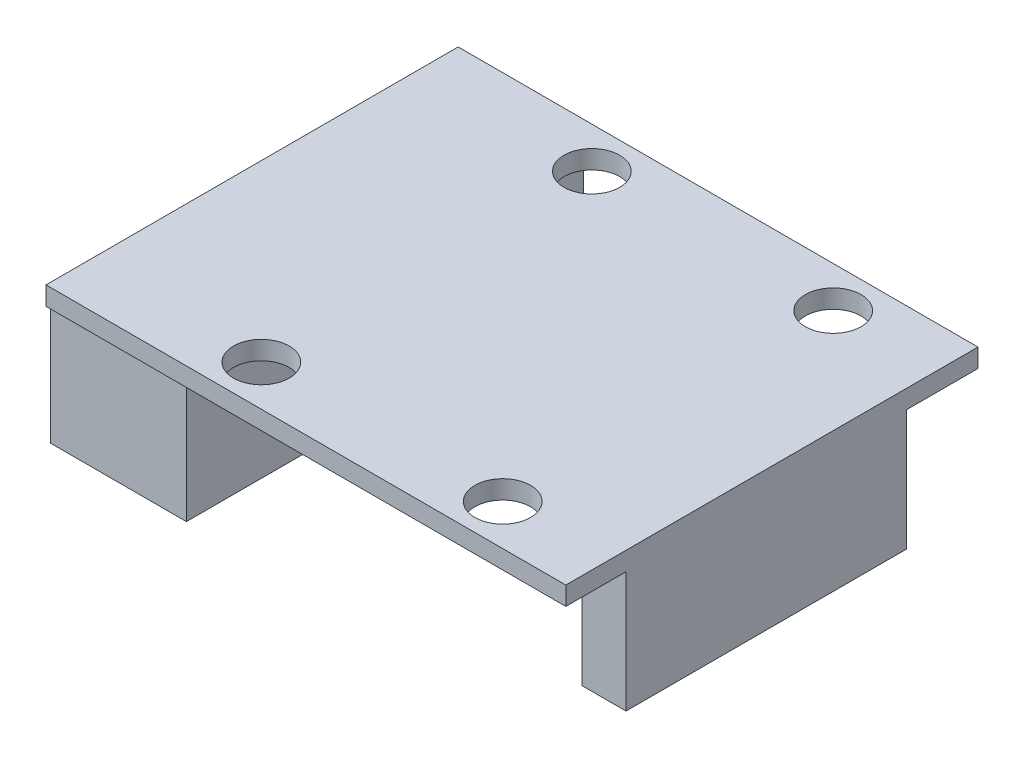
ISO-10303-21;
HEADER;
FILE_DESCRIPTION(('STEP AP214'),'2;1');
FILE_NAME('part.step','',(''),(''),'','','');
FILE_SCHEMA(('AUTOMOTIVE_DESIGN { 1 0 10303 214 1 1 1 1 }'));
ENDSEC;
DATA;
#1=APPLICATION_CONTEXT('core data for automotive mechanical design processes');
#2=APPLICATION_PROTOCOL_DEFINITION('international standard','automotive_design',2000,#1);
#3=PRODUCT_CONTEXT('',#1,'mechanical');
#4=PRODUCT('Part','Part','',(#3));
#5=PRODUCT_RELATED_PRODUCT_CATEGORY('part','',(#4));
#6=PRODUCT_DEFINITION_FORMATION('','',#4);
#7=PRODUCT_DEFINITION_CONTEXT('part definition',#1,'design');
#8=PRODUCT_DEFINITION('design','',#6,#7);
#9=PRODUCT_DEFINITION_SHAPE('','',#8);
#10=(LENGTH_UNIT() NAMED_UNIT(*) SI_UNIT(.MILLI.,.METRE.));
#11=(NAMED_UNIT(*) PLANE_ANGLE_UNIT() SI_UNIT($,.RADIAN.));
#12=(NAMED_UNIT(*) SI_UNIT($,.STERADIAN.) SOLID_ANGLE_UNIT());
#13=UNCERTAINTY_MEASURE_WITH_UNIT(LENGTH_MEASURE(1.E-05),#10,'distance_accuracy_value','');
#14=(GEOMETRIC_REPRESENTATION_CONTEXT(3) GLOBAL_UNCERTAINTY_ASSIGNED_CONTEXT((#13)) GLOBAL_UNIT_ASSIGNED_CONTEXT((#10,
#11,#12)) REPRESENTATION_CONTEXT('',''));
#15=CARTESIAN_POINT('',(0.,0.,0.));
#16=DIRECTION('',(0.,0.,1.));
#17=DIRECTION('',(1.,0.,0.));
#18=AXIS2_PLACEMENT_3D('',#15,#16,#17);
#19=CARTESIAN_POINT('',(0.,0.,0.));
#20=DIRECTION('',(0.,-1.,0.));
#21=DIRECTION('',(0.,0.,-1.));
#22=AXIS2_PLACEMENT_3D('',#19,#20,#21);
#23=PLANE('',#22);
#24=CARTESIAN_POINT('',(22.4,0.,-2.2));
#25=DIRECTION('',(0.,1.,0.));
#26=DIRECTION('',(0.,0.,1.));
#27=AXIS2_PLACEMENT_3D('',#24,#25,#26);
#28=CIRCLE('',#27,1.5);
#29=CARTESIAN_POINT('',(22.4,0.,-0.699999999999999));
#30=VERTEX_POINT('',#29);
#31=EDGE_CURVE('E279',#30,#30,#28,.T.);
#32=ORIENTED_EDGE('',*,*,#31,.T.);
#33=EDGE_LOOP('',(#32));
#34=FACE_BOUND('',#33,.T.);
#35=CARTESIAN_POINT('',(9.4,0.,-20.));
#36=DIRECTION('',(0.,1.,0.));
#37=DIRECTION('',(0.,0.,1.));
#38=AXIS2_PLACEMENT_3D('',#35,#36,#37);
#39=CIRCLE('',#38,1.5);
#40=CARTESIAN_POINT('',(9.4,0.,-18.5));
#41=VERTEX_POINT('',#40);
#42=EDGE_CURVE('E292',#41,#41,#39,.T.);
#43=ORIENTED_EDGE('',*,*,#42,.T.);
#44=EDGE_LOOP('',(#43));
#45=FACE_BOUND('',#44,.T.);
#46=CARTESIAN_POINT('',(22.4,0.,-20.));
#47=DIRECTION('',(0.,1.,0.));
#48=DIRECTION('',(0.,0.,1.));
#49=AXIS2_PLACEMENT_3D('',#46,#47,#48);
#50=CIRCLE('',#49,1.5);
#51=CARTESIAN_POINT('',(22.4,0.,-18.5));
#52=VERTEX_POINT('',#51);
#53=EDGE_CURVE('E286',#52,#52,#50,.T.);
#54=ORIENTED_EDGE('',*,*,#53,.T.);
#55=EDGE_LOOP('',(#54));
#56=FACE_BOUND('',#55,.T.);
#57=CARTESIAN_POINT('',(9.4,0.,-2.2));
#58=DIRECTION('',(0.,1.,0.));
#59=DIRECTION('',(0.,0.,1.));
#60=AXIS2_PLACEMENT_3D('',#57,#58,#59);
#61=CIRCLE('',#60,1.5);
#62=CARTESIAN_POINT('',(9.4,0.,-0.699999999999998));
#63=VERTEX_POINT('',#62);
#64=EDGE_CURVE('E274',#63,#63,#61,.T.);
#65=ORIENTED_EDGE('',*,*,#64,.T.);
#66=EDGE_LOOP('',(#65));
#67=FACE_BOUND('',#66,.T.);
#68=DIRECTION('',(0.,0.,-1.));
#69=VECTOR('',#68,1.);
#70=CARTESIAN_POINT('',(28.,0.,0.));
#71=LINE('',#70,#69);
#72=CARTESIAN_POINT('',(28.,0.,-18.354409606166));
#73=VERTEX_POINT('',#72);
#74=CARTESIAN_POINT('',(28.,0.,-22.2));
#75=VERTEX_POINT('',#74);
#76=EDGE_CURVE('E321',#73,#75,#71,.T.);
#77=ORIENTED_EDGE('',*,*,#76,.F.);
#78=DIRECTION('',(1.,0.,0.));
#79=VECTOR('',#78,1.);
#80=CARTESIAN_POINT('',(25.6254876265779,0.,-18.354409606166));
#81=LINE('',#80,#79);
#82=CARTESIAN_POINT('',(25.6254876265779,0.,-18.354409606166));
#83=VERTEX_POINT('',#82);
#84=EDGE_CURVE('E344',#83,#73,#81,.T.);
#85=ORIENTED_EDGE('',*,*,#84,.F.);
#86=DIRECTION('',(0.,0.,-1.));
#87=VECTOR('',#86,1.);
#88=CARTESIAN_POINT('',(25.6254876265779,0.,-18.354409606166));
#89=LINE('',#88,#87);
#90=CARTESIAN_POINT('',(25.6254876265779,0.,-3.23995910184949));
#91=VERTEX_POINT('',#90);
#92=EDGE_CURVE('E195',#91,#83,#89,.T.);
#93=ORIENTED_EDGE('',*,*,#92,.F.);
#94=DIRECTION('',(-1.,0.,0.));
#95=VECTOR('',#94,1.);
#96=CARTESIAN_POINT('',(25.6254876265779,0.,-3.23995910184949));
#97=LINE('',#96,#95);
#98=CARTESIAN_POINT('',(28.,0.,-3.23995910184949));
#99=VERTEX_POINT('',#98);
#100=EDGE_CURVE('E191',#99,#91,#97,.T.);
#101=ORIENTED_EDGE('',*,*,#100,.F.);
#102=CARTESIAN_POINT('',(28.,0.,0.));
#103=VERTEX_POINT('',#102);
#104=EDGE_CURVE('E322',#103,#99,#71,.T.);
#105=ORIENTED_EDGE('',*,*,#104,.F.);
#106=DIRECTION('',(1.,0.,0.));
#107=VECTOR('',#106,1.);
#108=CARTESIAN_POINT('',(0.,0.,0.));
#109=LINE('',#108,#107);
#110=CARTESIAN_POINT('',(0.,0.,0.));
#111=VERTEX_POINT('',#110);
#112=EDGE_CURVE('E317',#111,#103,#109,.T.);
#113=ORIENTED_EDGE('',*,*,#112,.F.);
#114=DIRECTION('',(0.,0.,1.));
#115=VECTOR('',#114,1.);
#116=CARTESIAN_POINT('',(0.,0.,0.));
#117=LINE('',#116,#115);
#118=CARTESIAN_POINT('',(0.,0.,-0.238134437228928));
#119=VERTEX_POINT('',#118);
#120=EDGE_CURVE('E298',#119,#111,#117,.T.);
#121=ORIENTED_EDGE('',*,*,#120,.F.);
#122=DIRECTION('',(-1.,0.,0.));
#123=VECTOR('',#122,1.);
#124=CARTESIAN_POINT('',(0.,0.,-0.238134437228928));
#125=LINE('',#124,#123);
#126=CARTESIAN_POINT('',(7.32488989051539,0.,-0.238134437228928));
#127=VERTEX_POINT('',#126);
#128=EDGE_CURVE('E211',#127,#119,#125,.T.);
#129=ORIENTED_EDGE('',*,*,#128,.F.);
#130=DIRECTION('',(0.,0.,1.));
#131=VECTOR('',#130,1.);
#132=CARTESIAN_POINT('',(7.32488989051539,0.,-10.5601981962743));
#133=LINE('',#132,#131);
#134=CARTESIAN_POINT('',(7.32488989051539,0.,-10.5601981962743));
#135=VERTEX_POINT('',#134);
#136=EDGE_CURVE('E200',#135,#127,#133,.T.);
#137=ORIENTED_EDGE('',*,*,#136,.F.);
#138=DIRECTION('',(1.,0.,0.));
#139=VECTOR('',#138,1.);
#140=CARTESIAN_POINT('',(0.,0.,-10.5601981962743));
#141=LINE('',#140,#139);
#142=CARTESIAN_POINT('',(0.,0.,-10.5601981962743));
#143=VERTEX_POINT('',#142);
#144=EDGE_CURVE('E197',#143,#135,#141,.T.);
#145=ORIENTED_EDGE('',*,*,#144,.F.);
#146=CARTESIAN_POINT('',(0.,0.,-11.429147441296));
#147=VERTEX_POINT('',#146);
#148=EDGE_CURVE('E318',#147,#143,#117,.T.);
#149=ORIENTED_EDGE('',*,*,#148,.F.);
#150=DIRECTION('',(-1.,0.,0.));
#151=VECTOR('',#150,1.);
#152=CARTESIAN_POINT('',(0.,0.,-11.429147441296));
#153=LINE('',#152,#151);
#154=CARTESIAN_POINT('',(7.14056732338946,0.,-11.429147441296));
#155=VERTEX_POINT('',#154);
#156=EDGE_CURVE('E243',#155,#147,#153,.T.);
#157=ORIENTED_EDGE('',*,*,#156,.F.);
#158=DIRECTION('',(0.,0.,1.));
#159=VECTOR('',#158,1.);
#160=CARTESIAN_POINT('',(7.14056732338946,0.,-21.8038747909487));
#161=LINE('',#160,#159);
#162=CARTESIAN_POINT('',(7.14056732338946,0.,-21.8038747909487));
#163=VERTEX_POINT('',#162);
#164=EDGE_CURVE('E254',#163,#155,#161,.T.);
#165=ORIENTED_EDGE('',*,*,#164,.F.);
#166=DIRECTION('',(1.,0.,0.));
#167=VECTOR('',#166,1.);
#168=CARTESIAN_POINT('',(0.,0.,-21.8038747909487));
#169=LINE('',#168,#167);
#170=CARTESIAN_POINT('',(0.,0.,-21.8038747909487));
#171=VERTEX_POINT('',#170);
#172=EDGE_CURVE('E237',#171,#163,#169,.T.);
#173=ORIENTED_EDGE('',*,*,#172,.F.);
#174=CARTESIAN_POINT('',(0.,0.,-22.2));
#175=VERTEX_POINT('',#174);
#176=EDGE_CURVE('E314',#175,#171,#117,.T.);
#177=ORIENTED_EDGE('',*,*,#176,.F.);
#178=DIRECTION('',(-1.,0.,0.));
#179=VECTOR('',#178,1.);
#180=CARTESIAN_POINT('',(0.,0.,-22.2));
#181=LINE('',#180,#179);
#182=EDGE_CURVE('E306',#75,#175,#181,.T.);
#183=ORIENTED_EDGE('',*,*,#182,.F.);
#184=EDGE_LOOP('',(#77,#85,#93,#101,#105,#113,#121,#129,#137,#145,#149,#157,#165,#173,#177,#183));
#185=FACE_BOUND('',#184,.T.);
#186=ADVANCED_FACE('F43',(#34,#45,#56,#67,#185),#23,.T.);
#187=CARTESIAN_POINT('',(0.,1.,0.));
#188=DIRECTION('',(0.,-1.,0.));
#189=DIRECTION('',(0.,0.,-1.));
#190=AXIS2_PLACEMENT_3D('',#187,#188,#189);
#191=PLANE('',#190);
#192=DIRECTION('',(0.,0.,1.));
#193=VECTOR('',#192,1.);
#194=CARTESIAN_POINT('',(0.,1.,0.));
#195=LINE('',#194,#193);
#196=CARTESIAN_POINT('',(0.,1.,-22.2));
#197=VERTEX_POINT('',#196);
#198=CARTESIAN_POINT('',(0.,1.,0.));
#199=VERTEX_POINT('',#198);
#200=EDGE_CURVE('E301',#197,#199,#195,.T.);
#201=ORIENTED_EDGE('',*,*,#200,.T.);
#202=DIRECTION('',(1.,0.,0.));
#203=VECTOR('',#202,1.);
#204=CARTESIAN_POINT('',(0.,1.,0.));
#205=LINE('',#204,#203);
#206=CARTESIAN_POINT('',(28.,1.,0.));
#207=VERTEX_POINT('',#206);
#208=EDGE_CURVE('E305',#199,#207,#205,.T.);
#209=ORIENTED_EDGE('',*,*,#208,.T.);
#210=DIRECTION('',(0.,0.,-1.));
#211=VECTOR('',#210,1.);
#212=CARTESIAN_POINT('',(28.,1.,0.));
#213=LINE('',#212,#211);
#214=CARTESIAN_POINT('',(28.,1.,-22.2));
#215=VERTEX_POINT('',#214);
#216=EDGE_CURVE('E309',#207,#215,#213,.T.);
#217=ORIENTED_EDGE('',*,*,#216,.T.);
#218=DIRECTION('',(-1.,0.,0.));
#219=VECTOR('',#218,1.);
#220=CARTESIAN_POINT('',(0.,1.,-22.2));
#221=LINE('',#220,#219);
#222=EDGE_CURVE('E311',#215,#197,#221,.T.);
#223=ORIENTED_EDGE('',*,*,#222,.T.);
#224=EDGE_LOOP('',(#201,#209,#217,#223));
#225=FACE_BOUND('',#224,.T.);
#226=CARTESIAN_POINT('',(9.4,1.,-20.));
#227=DIRECTION('',(0.,1.,0.));
#228=DIRECTION('',(0.,0.,1.));
#229=AXIS2_PLACEMENT_3D('',#226,#227,#228);
#230=CIRCLE('',#229,1.5);
#231=CARTESIAN_POINT('',(9.4,1.,-18.5));
#232=VERTEX_POINT('',#231);
#233=EDGE_CURVE('E295',#232,#232,#230,.T.);
#234=ORIENTED_EDGE('',*,*,#233,.F.);
#235=EDGE_LOOP('',(#234));
#236=FACE_BOUND('',#235,.T.);
#237=CARTESIAN_POINT('',(22.4,1.,-20.));
#238=DIRECTION('',(0.,1.,0.));
#239=DIRECTION('',(0.,0.,1.));
#240=AXIS2_PLACEMENT_3D('',#237,#238,#239);
#241=CIRCLE('',#240,1.5);
#242=CARTESIAN_POINT('',(22.4,1.,-18.5));
#243=VERTEX_POINT('',#242);
#244=EDGE_CURVE('E289',#243,#243,#241,.T.);
#245=ORIENTED_EDGE('',*,*,#244,.F.);
#246=EDGE_LOOP('',(#245));
#247=FACE_BOUND('',#246,.T.);
#248=CARTESIAN_POINT('',(22.4,1.,-2.2));
#249=DIRECTION('',(0.,1.,0.));
#250=DIRECTION('',(0.,0.,1.));
#251=AXIS2_PLACEMENT_3D('',#248,#249,#250);
#252=CIRCLE('',#251,1.5);
#253=CARTESIAN_POINT('',(22.4,1.,-0.699999999999999));
#254=VERTEX_POINT('',#253);
#255=EDGE_CURVE('E283',#254,#254,#252,.T.);
#256=ORIENTED_EDGE('',*,*,#255,.F.);
#257=EDGE_LOOP('',(#256));
#258=FACE_BOUND('',#257,.T.);
#259=CARTESIAN_POINT('',(9.4,1.,-2.2));
#260=DIRECTION('',(0.,1.,0.));
#261=DIRECTION('',(0.,0.,1.));
#262=AXIS2_PLACEMENT_3D('',#259,#260,#261);
#263=CIRCLE('',#262,1.5);
#264=CARTESIAN_POINT('',(9.4,1.,-0.699999999999998));
#265=VERTEX_POINT('',#264);
#266=EDGE_CURVE('E275',#265,#265,#263,.T.);
#267=ORIENTED_EDGE('',*,*,#266,.F.);
#268=EDGE_LOOP('',(#267));
#269=FACE_BOUND('',#268,.T.);
#270=ADVANCED_FACE('F366',(#225,#236,#247,#258,#269),#191,.F.);
#271=CARTESIAN_POINT('',(0.,1.,0.));
#272=DIRECTION('',(1.,0.,0.));
#273=DIRECTION('',(0.,0.,-1.));
#274=AXIS2_PLACEMENT_3D('',#271,#272,#273);
#275=PLANE('',#274);
#276=ORIENTED_EDGE('',*,*,#176,.T.);
#277=DIRECTION('',(0.,1.,0.));
#278=VECTOR('',#277,1.);
#279=CARTESIAN_POINT('',(0.,-6.5,-21.8038747909487));
#280=LINE('',#279,#278);
#281=CARTESIAN_POINT('',(0.,-6.5,-21.8038747909487));
#282=VERTEX_POINT('',#281);
#283=EDGE_CURVE('E271',#282,#171,#280,.T.);
#284=ORIENTED_EDGE('',*,*,#283,.F.);
#285=DIRECTION('',(0.,0.,-1.));
#286=VECTOR('',#285,1.);
#287=CARTESIAN_POINT('',(0.,-6.5,-21.8038747909487));
#288=LINE('',#287,#286);
#289=CARTESIAN_POINT('',(0.,-6.5,-11.429147441296));
#290=VERTEX_POINT('',#289);
#291=EDGE_CURVE('E238',#290,#282,#288,.T.);
#292=ORIENTED_EDGE('',*,*,#291,.F.);
#293=DIRECTION('',(0.,1.,0.));
#294=VECTOR('',#293,1.);
#295=CARTESIAN_POINT('',(0.,-6.5,-11.429147441296));
#296=LINE('',#295,#294);
#297=EDGE_CURVE('E251',#290,#147,#296,.T.);
#298=ORIENTED_EDGE('',*,*,#297,.T.);
#299=ORIENTED_EDGE('',*,*,#148,.T.);
#300=DIRECTION('',(0.,1.,0.));
#301=VECTOR('',#300,1.);
#302=CARTESIAN_POINT('',(0.,-6.5,-10.5601981962743));
#303=LINE('',#302,#301);
#304=CARTESIAN_POINT('',(0.,-6.5,-10.5601981962743));
#305=VERTEX_POINT('',#304);
#306=EDGE_CURVE('E234',#305,#143,#303,.T.);
#307=ORIENTED_EDGE('',*,*,#306,.F.);
#308=DIRECTION('',(0.,0.,-1.));
#309=VECTOR('',#308,1.);
#310=CARTESIAN_POINT('',(0.,-6.5,-10.5601981962743));
#311=LINE('',#310,#309);
#312=CARTESIAN_POINT('',(0.,-6.5,-0.238134437228928));
#313=VERTEX_POINT('',#312);
#314=EDGE_CURVE('E206',#313,#305,#311,.T.);
#315=ORIENTED_EDGE('',*,*,#314,.F.);
#316=DIRECTION('',(0.,1.,0.));
#317=VECTOR('',#316,1.);
#318=CARTESIAN_POINT('',(0.,-6.5,-0.238134437228928));
#319=LINE('',#318,#317);
#320=EDGE_CURVE('E70',#313,#119,#319,.T.);
#321=ORIENTED_EDGE('',*,*,#320,.T.);
#322=ORIENTED_EDGE('',*,*,#120,.T.);
#323=DIRECTION('',(0.,-1.,0.));
#324=VECTOR('',#323,1.);
#325=CARTESIAN_POINT('',(0.,1.,0.));
#326=LINE('',#325,#324);
#327=EDGE_CURVE('E11',#199,#111,#326,.T.);
#328=ORIENTED_EDGE('',*,*,#327,.F.);
#329=ORIENTED_EDGE('',*,*,#200,.F.);
#330=DIRECTION('',(0.,-1.,0.));
#331=VECTOR('',#330,1.);
#332=CARTESIAN_POINT('',(0.,1.,-22.2));
#333=LINE('',#332,#331);
#334=EDGE_CURVE('E313',#197,#175,#333,.T.);
#335=ORIENTED_EDGE('',*,*,#334,.T.);
#336=EDGE_LOOP('',(#276,#284,#292,#298,#299,#307,#315,#321,#322,#328,#329,#335));
#337=FACE_BOUND('',#336,.T.);
#338=ADVANCED_FACE('F45',(#337),#275,.F.);
#339=CARTESIAN_POINT('',(0.,1.,0.));
#340=DIRECTION('',(0.,0.,-1.));
#341=DIRECTION('',(-1.,0.,0.));
#342=AXIS2_PLACEMENT_3D('',#339,#340,#341);
#343=PLANE('',#342);
#344=ORIENTED_EDGE('',*,*,#112,.T.);
#345=DIRECTION('',(0.,-1.,0.));
#346=VECTOR('',#345,1.);
#347=CARTESIAN_POINT('',(28.,1.,0.));
#348=LINE('',#347,#346);
#349=EDGE_CURVE('E52',#207,#103,#348,.T.);
#350=ORIENTED_EDGE('',*,*,#349,.F.);
#351=ORIENTED_EDGE('',*,*,#208,.F.);
#352=ORIENTED_EDGE('',*,*,#327,.T.);
#353=EDGE_LOOP('',(#344,#350,#351,#352));
#354=FACE_BOUND('',#353,.T.);
#355=ADVANCED_FACE('F384',(#354),#343,.F.);
#356=CARTESIAN_POINT('',(28.,1.,0.));
#357=DIRECTION('',(-1.,0.,0.));
#358=DIRECTION('',(0.,0.,1.));
#359=AXIS2_PLACEMENT_3D('',#356,#357,#358);
#360=PLANE('',#359);
#361=ORIENTED_EDGE('',*,*,#104,.T.);
#362=DIRECTION('',(0.,1.,0.));
#363=VECTOR('',#362,1.);
#364=CARTESIAN_POINT('',(28.,-6.5,-3.23995910184949));
#365=LINE('',#364,#363);
#366=CARTESIAN_POINT('',(28.,-6.5,-3.23995910184949));
#367=VERTEX_POINT('',#366);
#368=EDGE_CURVE('E202',#367,#99,#365,.T.);
#369=ORIENTED_EDGE('',*,*,#368,.F.);
#370=DIRECTION('',(0.,0.,1.));
#371=VECTOR('',#370,1.);
#372=CARTESIAN_POINT('',(28.,-6.5,-18.354409606166));
#373=LINE('',#372,#371);
#374=CARTESIAN_POINT('',(28.,-6.5,-18.354409606166));
#375=VERTEX_POINT('',#374);
#376=EDGE_CURVE('E180',#375,#367,#373,.T.);
#377=ORIENTED_EDGE('',*,*,#376,.F.);
#378=DIRECTION('',(0.,1.,0.));
#379=VECTOR('',#378,1.);
#380=CARTESIAN_POINT('',(28.,-6.5,-18.354409606166));
#381=LINE('',#380,#379);
#382=EDGE_CURVE('E59',#375,#73,#381,.T.);
#383=ORIENTED_EDGE('',*,*,#382,.T.);
#384=ORIENTED_EDGE('',*,*,#76,.T.);
#385=DIRECTION('',(0.,-1.,0.));
#386=VECTOR('',#385,1.);
#387=CARTESIAN_POINT('',(28.,1.,-22.2));
#388=LINE('',#387,#386);
#389=EDGE_CURVE('E328',#215,#75,#388,.T.);
#390=ORIENTED_EDGE('',*,*,#389,.F.);
#391=ORIENTED_EDGE('',*,*,#216,.F.);
#392=ORIENTED_EDGE('',*,*,#349,.T.);
#393=EDGE_LOOP('',(#361,#369,#377,#383,#384,#390,#391,#392));
#394=FACE_BOUND('',#393,.T.);
#395=ADVANCED_FACE('F334',(#394),#360,.F.);
#396=CARTESIAN_POINT('',(0.,1.,-22.2));
#397=DIRECTION('',(0.,0.,1.));
#398=DIRECTION('',(1.,0.,0.));
#399=AXIS2_PLACEMENT_3D('',#396,#397,#398);
#400=PLANE('',#399);
#401=ORIENTED_EDGE('',*,*,#182,.T.);
#402=ORIENTED_EDGE('',*,*,#334,.F.);
#403=ORIENTED_EDGE('',*,*,#222,.F.);
#404=ORIENTED_EDGE('',*,*,#389,.T.);
#405=EDGE_LOOP('',(#401,#402,#403,#404));
#406=FACE_BOUND('',#405,.T.);
#407=ADVANCED_FACE('F378',(#406),#400,.F.);
#408=CARTESIAN_POINT('',(9.4,1.,-20.));
#409=DIRECTION('',(0.,-1.,0.));
#410=DIRECTION('',(0.,0.,-1.));
#411=AXIS2_PLACEMENT_3D('',#408,#409,#410);
#412=CYLINDRICAL_SURFACE('',#411,1.5);
#413=ORIENTED_EDGE('',*,*,#233,.T.);
#414=EDGE_LOOP('',(#413));
#415=FACE_BOUND('',#414,.T.);
#416=ORIENTED_EDGE('',*,*,#42,.F.);
#417=EDGE_LOOP('',(#416));
#418=FACE_BOUND('',#417,.T.);
#419=ADVANCED_FACE('F381',(#415,#418),#412,.F.);
#420=CARTESIAN_POINT('',(22.4,1.,-20.));
#421=DIRECTION('',(0.,-1.,0.));
#422=DIRECTION('',(0.,0.,-1.));
#423=AXIS2_PLACEMENT_3D('',#420,#421,#422);
#424=CYLINDRICAL_SURFACE('',#423,1.5);
#425=ORIENTED_EDGE('',*,*,#244,.T.);
#426=EDGE_LOOP('',(#425));
#427=FACE_BOUND('',#426,.T.);
#428=ORIENTED_EDGE('',*,*,#53,.F.);
#429=EDGE_LOOP('',(#428));
#430=FACE_BOUND('',#429,.T.);
#431=ADVANCED_FACE('F438',(#427,#430),#424,.F.);
#432=CARTESIAN_POINT('',(22.4,1.,-2.2));
#433=DIRECTION('',(0.,-1.,0.));
#434=DIRECTION('',(0.,0.,-1.));
#435=AXIS2_PLACEMENT_3D('',#432,#433,#434);
#436=CYLINDRICAL_SURFACE('',#435,1.5);
#437=ORIENTED_EDGE('',*,*,#255,.T.);
#438=EDGE_LOOP('',(#437));
#439=FACE_BOUND('',#438,.T.);
#440=ORIENTED_EDGE('',*,*,#31,.F.);
#441=EDGE_LOOP('',(#440));
#442=FACE_BOUND('',#441,.T.);
#443=ADVANCED_FACE('F428',(#439,#442),#436,.F.);
#444=CARTESIAN_POINT('',(9.4,1.,-2.2));
#445=DIRECTION('',(0.,-1.,0.));
#446=DIRECTION('',(0.,0.,-1.));
#447=AXIS2_PLACEMENT_3D('',#444,#445,#446);
#448=CYLINDRICAL_SURFACE('',#447,1.5);
#449=ORIENTED_EDGE('',*,*,#266,.T.);
#450=EDGE_LOOP('',(#449));
#451=FACE_BOUND('',#450,.T.);
#452=ORIENTED_EDGE('',*,*,#64,.F.);
#453=EDGE_LOOP('',(#452));
#454=FACE_BOUND('',#453,.T.);
#455=ADVANCED_FACE('F425',(#451,#454),#448,.F.);
#456=CARTESIAN_POINT('',(0.,-6.5,-21.8038747909487));
#457=DIRECTION('',(0.,0.,1.));
#458=DIRECTION('',(1.,0.,0.));
#459=AXIS2_PLACEMENT_3D('',#456,#457,#458);
#460=PLANE('',#459);
#461=ORIENTED_EDGE('',*,*,#172,.T.);
#462=DIRECTION('',(0.,1.,0.));
#463=VECTOR('',#462,1.);
#464=CARTESIAN_POINT('',(7.14056732338946,-6.5,-21.8038747909487));
#465=LINE('',#464,#463);
#466=CARTESIAN_POINT('',(7.14056732338946,-6.5,-21.8038747909487));
#467=VERTEX_POINT('',#466);
#468=EDGE_CURVE('E268',#467,#163,#465,.T.);
#469=ORIENTED_EDGE('',*,*,#468,.F.);
#470=DIRECTION('',(1.,0.,0.));
#471=VECTOR('',#470,1.);
#472=CARTESIAN_POINT('',(0.,-6.5,-21.8038747909487));
#473=LINE('',#472,#471);
#474=EDGE_CURVE('E242',#282,#467,#473,.T.);
#475=ORIENTED_EDGE('',*,*,#474,.F.);
#476=ORIENTED_EDGE('',*,*,#283,.T.);
#477=EDGE_LOOP('',(#461,#469,#475,#476));
#478=FACE_BOUND('',#477,.T.);
#479=ADVANCED_FACE('F411',(#478),#460,.F.);
#480=CARTESIAN_POINT('',(7.14056732338946,-6.5,-21.8038747909487));
#481=DIRECTION('',(-1.,0.,0.));
#482=DIRECTION('',(0.,0.,1.));
#483=AXIS2_PLACEMENT_3D('',#480,#481,#482);
#484=PLANE('',#483);
#485=ORIENTED_EDGE('',*,*,#164,.T.);
#486=DIRECTION('',(0.,1.,0.));
#487=VECTOR('',#486,1.);
#488=CARTESIAN_POINT('',(7.14056732338946,-6.5,-11.429147441296));
#489=LINE('',#488,#487);
#490=CARTESIAN_POINT('',(7.14056732338946,-6.5,-11.429147441296));
#491=VERTEX_POINT('',#490);
#492=EDGE_CURVE('E264',#491,#155,#489,.T.);
#493=ORIENTED_EDGE('',*,*,#492,.F.);
#494=DIRECTION('',(0.,0.,1.));
#495=VECTOR('',#494,1.);
#496=CARTESIAN_POINT('',(7.14056732338946,-6.5,-21.8038747909487));
#497=LINE('',#496,#495);
#498=EDGE_CURVE('E245',#467,#491,#497,.T.);
#499=ORIENTED_EDGE('',*,*,#498,.F.);
#500=ORIENTED_EDGE('',*,*,#468,.T.);
#501=EDGE_LOOP('',(#485,#493,#499,#500));
#502=FACE_BOUND('',#501,.T.);
#503=ADVANCED_FACE('F407',(#502),#484,.F.);
#504=CARTESIAN_POINT('',(0.,-6.5,-11.429147441296));
#505=DIRECTION('',(0.,0.,-1.));
#506=DIRECTION('',(-1.,0.,0.));
#507=AXIS2_PLACEMENT_3D('',#504,#505,#506);
#508=PLANE('',#507);
#509=ORIENTED_EDGE('',*,*,#156,.T.);
#510=ORIENTED_EDGE('',*,*,#297,.F.);
#511=DIRECTION('',(-1.,0.,0.));
#512=VECTOR('',#511,1.);
#513=CARTESIAN_POINT('',(0.,-6.5,-11.429147441296));
#514=LINE('',#513,#512);
#515=EDGE_CURVE('E248',#491,#290,#514,.T.);
#516=ORIENTED_EDGE('',*,*,#515,.F.);
#517=ORIENTED_EDGE('',*,*,#492,.T.);
#518=EDGE_LOOP('',(#509,#510,#516,#517));
#519=FACE_BOUND('',#518,.T.);
#520=ADVANCED_FACE('F402',(#519),#508,.F.);
#521=CARTESIAN_POINT('',(0.,-6.5,0.));
#522=DIRECTION('',(0.,1.,0.));
#523=DIRECTION('',(0.,0.,1.));
#524=AXIS2_PLACEMENT_3D('',#521,#522,#523);
#525=PLANE('',#524);
#526=ORIENTED_EDGE('',*,*,#291,.T.);
#527=ORIENTED_EDGE('',*,*,#474,.T.);
#528=ORIENTED_EDGE('',*,*,#498,.T.);
#529=ORIENTED_EDGE('',*,*,#515,.T.);
#530=EDGE_LOOP('',(#526,#527,#528,#529));
#531=FACE_BOUND('',#530,.T.);
#532=ADVANCED_FACE('F510',(#531),#525,.F.);
#533=CARTESIAN_POINT('',(0.,-6.5,-10.5601981962743));
#534=DIRECTION('',(0.,0.,1.));
#535=DIRECTION('',(1.,0.,0.));
#536=AXIS2_PLACEMENT_3D('',#533,#534,#535);
#537=PLANE('',#536);
#538=ORIENTED_EDGE('',*,*,#144,.T.);
#539=DIRECTION('',(0.,1.,0.));
#540=VECTOR('',#539,1.);
#541=CARTESIAN_POINT('',(7.32488989051539,-6.5,-10.5601981962743));
#542=LINE('',#541,#540);
#543=CARTESIAN_POINT('',(7.32488989051539,-6.5,-10.5601981962743));
#544=VERTEX_POINT('',#543);
#545=EDGE_CURVE('E230',#544,#135,#542,.T.);
#546=ORIENTED_EDGE('',*,*,#545,.F.);
#547=DIRECTION('',(1.,0.,0.));
#548=VECTOR('',#547,1.);
#549=CARTESIAN_POINT('',(0.,-6.5,-10.5601981962743));
#550=LINE('',#549,#548);
#551=EDGE_CURVE('E210',#305,#544,#550,.T.);
#552=ORIENTED_EDGE('',*,*,#551,.F.);
#553=ORIENTED_EDGE('',*,*,#306,.T.);
#554=EDGE_LOOP('',(#538,#546,#552,#553));
#555=FACE_BOUND('',#554,.T.);
#556=ADVANCED_FACE('F519',(#555),#537,.F.);
#557=CARTESIAN_POINT('',(7.32488989051539,-6.5,-10.5601981962743));
#558=DIRECTION('',(-1.,0.,0.));
#559=DIRECTION('',(0.,0.,1.));
#560=AXIS2_PLACEMENT_3D('',#557,#558,#559);
#561=PLANE('',#560);
#562=ORIENTED_EDGE('',*,*,#136,.T.);
#563=DIRECTION('',(0.,1.,0.));
#564=VECTOR('',#563,1.);
#565=CARTESIAN_POINT('',(7.32488989051539,-6.5,-0.238134437228928));
#566=LINE('',#565,#564);
#567=CARTESIAN_POINT('',(7.32488989051539,-6.5,-0.238134437228928));
#568=VERTEX_POINT('',#567);
#569=EDGE_CURVE('E226',#568,#127,#566,.T.);
#570=ORIENTED_EDGE('',*,*,#569,.F.);
#571=DIRECTION('',(0.,0.,1.));
#572=VECTOR('',#571,1.);
#573=CARTESIAN_POINT('',(7.32488989051539,-6.5,-10.5601981962743));
#574=LINE('',#573,#572);
#575=EDGE_CURVE('E214',#544,#568,#574,.T.);
#576=ORIENTED_EDGE('',*,*,#575,.F.);
#577=ORIENTED_EDGE('',*,*,#545,.T.);
#578=EDGE_LOOP('',(#562,#570,#576,#577));
#579=FACE_BOUND('',#578,.T.);
#580=ADVANCED_FACE('F529',(#579),#561,.F.);
#581=CARTESIAN_POINT('',(0.,-6.5,-0.238134437228928));
#582=DIRECTION('',(0.,0.,-1.));
#583=DIRECTION('',(-1.,0.,0.));
#584=AXIS2_PLACEMENT_3D('',#581,#582,#583);
#585=PLANE('',#584);
#586=ORIENTED_EDGE('',*,*,#128,.T.);
#587=ORIENTED_EDGE('',*,*,#320,.F.);
#588=DIRECTION('',(-1.,0.,0.));
#589=VECTOR('',#588,1.);
#590=CARTESIAN_POINT('',(0.,-6.5,-0.238134437228928));
#591=LINE('',#590,#589);
#592=EDGE_CURVE('E217',#568,#313,#591,.T.);
#593=ORIENTED_EDGE('',*,*,#592,.F.);
#594=ORIENTED_EDGE('',*,*,#569,.T.);
#595=EDGE_LOOP('',(#586,#587,#593,#594));
#596=FACE_BOUND('',#595,.T.);
#597=ADVANCED_FACE('F540',(#596),#585,.F.);
#598=CARTESIAN_POINT('',(0.,-6.5,0.));
#599=DIRECTION('',(0.,1.,0.));
#600=DIRECTION('',(0.,0.,1.));
#601=AXIS2_PLACEMENT_3D('',#598,#599,#600);
#602=PLANE('',#601);
#603=ORIENTED_EDGE('',*,*,#314,.T.);
#604=ORIENTED_EDGE('',*,*,#551,.T.);
#605=ORIENTED_EDGE('',*,*,#575,.T.);
#606=ORIENTED_EDGE('',*,*,#592,.T.);
#607=EDGE_LOOP('',(#603,#604,#605,#606));
#608=FACE_BOUND('',#607,.T.);
#609=ADVANCED_FACE('F551',(#608),#602,.F.);
#610=CARTESIAN_POINT('',(25.6254876265779,-6.5,-18.354409606166));
#611=DIRECTION('',(1.,0.,0.));
#612=DIRECTION('',(0.,0.,-1.));
#613=AXIS2_PLACEMENT_3D('',#610,#611,#612);
#614=PLANE('',#613);
#615=ORIENTED_EDGE('',*,*,#92,.T.);
#616=DIRECTION('',(0.,1.,0.));
#617=VECTOR('',#616,1.);
#618=CARTESIAN_POINT('',(25.6254876265779,-6.5,-18.354409606166));
#619=LINE('',#618,#617);
#620=CARTESIAN_POINT('',(25.6254876265779,-6.5,-18.354409606166));
#621=VERTEX_POINT('',#620);
#622=EDGE_CURVE('E177',#621,#83,#619,.T.);
#623=ORIENTED_EDGE('',*,*,#622,.F.);
#624=DIRECTION('',(0.,0.,-1.));
#625=VECTOR('',#624,1.);
#626=CARTESIAN_POINT('',(25.6254876265779,-6.5,-18.354409606166));
#627=LINE('',#626,#625);
#628=CARTESIAN_POINT('',(25.6254876265779,-6.5,-3.23995910184949));
#629=VERTEX_POINT('',#628);
#630=EDGE_CURVE('E181',#629,#621,#627,.T.);
#631=ORIENTED_EDGE('',*,*,#630,.F.);
#632=DIRECTION('',(0.,1.,0.));
#633=VECTOR('',#632,1.);
#634=CARTESIAN_POINT('',(25.6254876265779,-6.5,-3.23995910184949));
#635=LINE('',#634,#633);
#636=EDGE_CURVE('E349',#629,#91,#635,.T.);
#637=ORIENTED_EDGE('',*,*,#636,.T.);
#638=EDGE_LOOP('',(#615,#623,#631,#637));
#639=FACE_BOUND('',#638,.T.);
#640=ADVANCED_FACE('F193',(#639),#614,.F.);
#641=CARTESIAN_POINT('',(25.6254876265779,-6.5,-18.354409606166));
#642=DIRECTION('',(0.,0.,1.));
#643=DIRECTION('',(1.,0.,0.));
#644=AXIS2_PLACEMENT_3D('',#641,#642,#643);
#645=PLANE('',#644);
#646=ORIENTED_EDGE('',*,*,#84,.T.);
#647=ORIENTED_EDGE('',*,*,#382,.F.);
#648=DIRECTION('',(1.,0.,0.));
#649=VECTOR('',#648,1.);
#650=CARTESIAN_POINT('',(25.6254876265779,-6.5,-18.354409606166));
#651=LINE('',#650,#649);
#652=EDGE_CURVE('E173',#621,#375,#651,.T.);
#653=ORIENTED_EDGE('',*,*,#652,.F.);
#654=ORIENTED_EDGE('',*,*,#622,.T.);
#655=EDGE_LOOP('',(#646,#647,#653,#654));
#656=FACE_BOUND('',#655,.T.);
#657=ADVANCED_FACE('F175',(#656),#645,.F.);
#658=CARTESIAN_POINT('',(25.6254876265779,-6.5,-3.23995910184949));
#659=DIRECTION('',(0.,0.,-1.));
#660=DIRECTION('',(-1.,0.,0.));
#661=AXIS2_PLACEMENT_3D('',#658,#659,#660);
#662=PLANE('',#661);
#663=ORIENTED_EDGE('',*,*,#100,.T.);
#664=ORIENTED_EDGE('',*,*,#636,.F.);
#665=DIRECTION('',(-1.,0.,0.));
#666=VECTOR('',#665,1.);
#667=CARTESIAN_POINT('',(25.6254876265779,-6.5,-3.23995910184949));
#668=LINE('',#667,#666);
#669=EDGE_CURVE('E186',#367,#629,#668,.T.);
#670=ORIENTED_EDGE('',*,*,#669,.F.);
#671=ORIENTED_EDGE('',*,*,#368,.T.);
#672=EDGE_LOOP('',(#663,#664,#670,#671));
#673=FACE_BOUND('',#672,.T.);
#674=ADVANCED_FACE('F353',(#673),#662,.F.);
#675=CARTESIAN_POINT('',(0.,-6.5,0.));
#676=DIRECTION('',(0.,1.,0.));
#677=DIRECTION('',(0.,0.,1.));
#678=AXIS2_PLACEMENT_3D('',#675,#676,#677);
#679=PLANE('',#678);
#680=ORIENTED_EDGE('',*,*,#630,.T.);
#681=ORIENTED_EDGE('',*,*,#652,.T.);
#682=ORIENTED_EDGE('',*,*,#376,.T.);
#683=ORIENTED_EDGE('',*,*,#669,.T.);
#684=EDGE_LOOP('',(#680,#681,#682,#683));
#685=FACE_BOUND('',#684,.T.);
#686=ADVANCED_FACE('F184',(#685),#679,.F.);
#687=CLOSED_SHELL('',(#186,#270,#338,#355,#395,#407,#419,#431,#443,#455,#479,#503,#520,#532,
#556,#580,#597,#609,#640,#657,#674,#686));
#688=MANIFOLD_SOLID_BREP('B2',#687);
#689=ADVANCED_BREP_SHAPE_REPRESENTATION('',(#18,#688),#14);
#690=SHAPE_DEFINITION_REPRESENTATION(#9,#689);
ENDSEC;
END-ISO-10303-21;
